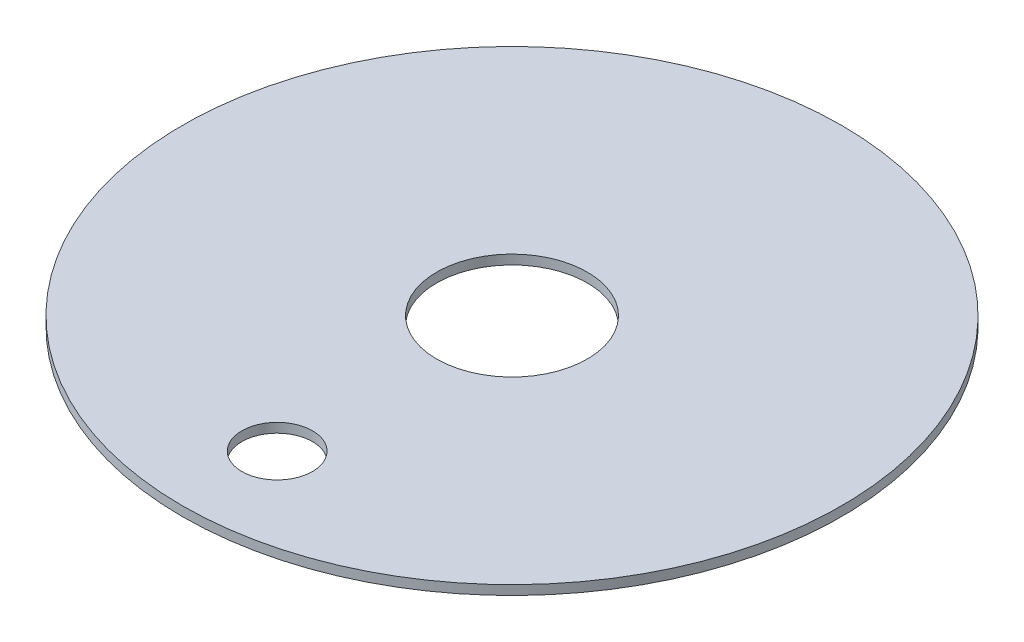
ISO-10303-21;
HEADER;
FILE_DESCRIPTION(('STEP AP214'),'2;1');
FILE_NAME('part.step','',(''),(''),'','','');
FILE_SCHEMA(('AUTOMOTIVE_DESIGN { 1 0 10303 214 1 1 1 1 }'));
ENDSEC;
DATA;
#1=APPLICATION_CONTEXT('core data for automotive mechanical design processes');
#2=APPLICATION_PROTOCOL_DEFINITION('international standard','automotive_design',2000,#1);
#3=PRODUCT_CONTEXT('',#1,'mechanical');
#4=PRODUCT('Part','Part','',(#3));
#5=PRODUCT_RELATED_PRODUCT_CATEGORY('part','',(#4));
#6=PRODUCT_DEFINITION_FORMATION('','',#4);
#7=PRODUCT_DEFINITION_CONTEXT('part definition',#1,'design');
#8=PRODUCT_DEFINITION('design','',#6,#7);
#9=PRODUCT_DEFINITION_SHAPE('','',#8);
#10=(LENGTH_UNIT() NAMED_UNIT(*) SI_UNIT(.MILLI.,.METRE.));
#11=(NAMED_UNIT(*) PLANE_ANGLE_UNIT() SI_UNIT($,.RADIAN.));
#12=(NAMED_UNIT(*) SI_UNIT($,.STERADIAN.) SOLID_ANGLE_UNIT());
#13=UNCERTAINTY_MEASURE_WITH_UNIT(LENGTH_MEASURE(1.E-05),#10,'distance_accuracy_value','');
#14=(GEOMETRIC_REPRESENTATION_CONTEXT(3) GLOBAL_UNCERTAINTY_ASSIGNED_CONTEXT((#13)) GLOBAL_UNIT_ASSIGNED_CONTEXT((#10,
#11,#12)) REPRESENTATION_CONTEXT('',''));
#15=CARTESIAN_POINT('',(0.,0.,0.));
#16=DIRECTION('',(0.,0.,1.));
#17=DIRECTION('',(1.,0.,0.));
#18=AXIS2_PLACEMENT_3D('',#15,#16,#17);
#19=CARTESIAN_POINT('',(0.,2.,0.));
#20=DIRECTION('',(0.,-1.,0.));
#21=DIRECTION('',(0.,0.,-1.));
#22=AXIS2_PLACEMENT_3D('',#19,#20,#21);
#23=CYLINDRICAL_SURFACE('',#22,70.);
#24=CARTESIAN_POINT('',(0.,2.,0.));
#25=DIRECTION('',(0.,1.,0.));
#26=DIRECTION('',(0.,0.,1.));
#27=AXIS2_PLACEMENT_3D('',#24,#25,#26);
#28=CIRCLE('',#27,70.);
#29=CARTESIAN_POINT('',(0.,2.,70.0000000000002));
#30=VERTEX_POINT('',#29);
#31=EDGE_CURVE('E48',#30,#30,#28,.T.);
#32=ORIENTED_EDGE('',*,*,#31,.F.);
#33=EDGE_LOOP('',(#32));
#34=FACE_BOUND('',#33,.T.);
#35=CARTESIAN_POINT('',(0.,0.,0.));
#36=DIRECTION('',(0.,1.,0.));
#37=DIRECTION('',(0.,0.,1.));
#38=AXIS2_PLACEMENT_3D('',#35,#36,#37);
#39=CIRCLE('',#38,70.);
#40=CARTESIAN_POINT('',(0.,0.,70.0000000000002));
#41=VERTEX_POINT('',#40);
#42=EDGE_CURVE('E54',#41,#41,#39,.T.);
#43=ORIENTED_EDGE('',*,*,#42,.T.);
#44=EDGE_LOOP('',(#43));
#45=FACE_BOUND('',#44,.T.);
#46=ADVANCED_FACE('F40',(#34,#45),#23,.T.);
#47=CARTESIAN_POINT('',(0.,2.,0.));
#48=DIRECTION('',(0.,1.,0.));
#49=DIRECTION('',(0.,0.,1.));
#50=AXIS2_PLACEMENT_3D('',#47,#48,#49);
#51=PLANE('',#50);
#52=CARTESIAN_POINT('',(0.,2.,49.88));
#53=DIRECTION('',(0.,1.,0.));
#54=DIRECTION('',(0.,0.,1.));
#55=AXIS2_PLACEMENT_3D('',#52,#53,#54);
#56=CIRCLE('',#55,7.5);
#57=CARTESIAN_POINT('',(0.,2.,57.38));
#58=VERTEX_POINT('',#57);
#59=EDGE_CURVE('E69',#58,#58,#56,.T.);
#60=ORIENTED_EDGE('',*,*,#59,.F.);
#61=EDGE_LOOP('',(#60));
#62=FACE_BOUND('',#61,.T.);
#63=CARTESIAN_POINT('',(0.,2.,0.));
#64=DIRECTION('',(0.,1.,0.));
#65=DIRECTION('',(0.,0.,1.));
#66=AXIS2_PLACEMENT_3D('',#63,#64,#65);
#67=CIRCLE('',#66,16.);
#68=CARTESIAN_POINT('',(0.,2.,16.));
#69=VERTEX_POINT('',#68);
#70=EDGE_CURVE('E68',#69,#69,#67,.T.);
#71=ORIENTED_EDGE('',*,*,#70,.F.);
#72=EDGE_LOOP('',(#71));
#73=FACE_BOUND('',#72,.T.);
#74=ORIENTED_EDGE('',*,*,#31,.T.);
#75=EDGE_LOOP('',(#74));
#76=FACE_BOUND('',#75,.T.);
#77=ADVANCED_FACE('F102',(#62,#73,#76),#51,.T.);
#78=CARTESIAN_POINT('',(0.,0.,0.));
#79=DIRECTION('',(0.,1.,0.));
#80=DIRECTION('',(0.,0.,1.));
#81=AXIS2_PLACEMENT_3D('',#78,#79,#80);
#82=PLANE('',#81);
#83=CARTESIAN_POINT('',(0.,0.,60.8800000000002));
#84=DIRECTION('',(0.,1.,0.));
#85=DIRECTION('',(0.,0.,1.));
#86=AXIS2_PLACEMENT_3D('',#83,#84,#85);
#87=CIRCLE('',#86,1.);
#88=CARTESIAN_POINT('',(0.,0.,61.8800000000002));
#89=VERTEX_POINT('',#88);
#90=EDGE_CURVE('E77',#89,#89,#87,.T.);
#91=ORIENTED_EDGE('',*,*,#90,.T.);
#92=EDGE_LOOP('',(#91));
#93=FACE_BOUND('',#92,.T.);
#94=CARTESIAN_POINT('',(0.,0.,49.88));
#95=DIRECTION('',(0.,1.,0.));
#96=DIRECTION('',(0.,0.,1.));
#97=AXIS2_PLACEMENT_3D('',#94,#95,#96);
#98=CIRCLE('',#97,7.5);
#99=CARTESIAN_POINT('',(0.,0.,57.38));
#100=VERTEX_POINT('',#99);
#101=EDGE_CURVE('E65',#100,#100,#98,.T.);
#102=ORIENTED_EDGE('',*,*,#101,.T.);
#103=EDGE_LOOP('',(#102));
#104=FACE_BOUND('',#103,.T.);
#105=CARTESIAN_POINT('',(0.,0.,0.));
#106=DIRECTION('',(0.,1.,0.));
#107=DIRECTION('',(0.,0.,1.));
#108=AXIS2_PLACEMENT_3D('',#105,#106,#107);
#109=CIRCLE('',#108,16.);
#110=CARTESIAN_POINT('',(0.,0.,16.));
#111=VERTEX_POINT('',#110);
#112=EDGE_CURVE('E61',#111,#111,#109,.F.);
#113=ORIENTED_EDGE('',*,*,#112,.F.);
#114=EDGE_LOOP('',(#113));
#115=FACE_BOUND('',#114,.T.);
#116=ORIENTED_EDGE('',*,*,#42,.F.);
#117=EDGE_LOOP('',(#116));
#118=FACE_BOUND('',#117,.T.);
#119=ADVANCED_FACE('F88',(#93,#104,#115,#118),#82,.F.);
#120=CARTESIAN_POINT('',(0.,-0.001000000000001,0.));
#121=DIRECTION('',(0.,1.,0.));
#122=DIRECTION('',(0.,0.,1.));
#123=AXIS2_PLACEMENT_3D('',#120,#121,#122);
#124=CYLINDRICAL_SURFACE('',#123,16.);
#125=ORIENTED_EDGE('',*,*,#70,.T.);
#126=EDGE_LOOP('',(#125));
#127=FACE_BOUND('',#126,.T.);
#128=ORIENTED_EDGE('',*,*,#112,.T.);
#129=EDGE_LOOP('',(#128));
#130=FACE_BOUND('',#129,.T.);
#131=ADVANCED_FACE('F99',(#127,#130),#124,.F.);
#132=CARTESIAN_POINT('',(0.,-8.00000000000001,49.88));
#133=DIRECTION('',(0.,1.,0.));
#134=DIRECTION('',(0.,0.,1.));
#135=AXIS2_PLACEMENT_3D('',#132,#133,#134);
#136=CYLINDRICAL_SURFACE('',#135,7.5);
#137=ORIENTED_EDGE('',*,*,#59,.T.);
#138=EDGE_LOOP('',(#137));
#139=FACE_BOUND('',#138,.T.);
#140=ORIENTED_EDGE('',*,*,#101,.F.);
#141=EDGE_LOOP('',(#140));
#142=FACE_BOUND('',#141,.T.);
#143=ADVANCED_FACE('F92',(#139,#142),#136,.F.);
#144=CARTESIAN_POINT('',(0.,-4.,60.8800000000002));
#145=DIRECTION('',(0.,1.,0.));
#146=DIRECTION('',(0.,0.,1.));
#147=AXIS2_PLACEMENT_3D('',#144,#145,#146);
#148=CYLINDRICAL_SURFACE('',#147,1.);
#149=CARTESIAN_POINT('',(0.,-3.,60.8800000000002));
#150=DIRECTION('',(0.,1.,0.));
#151=DIRECTION('',(0.,0.,1.));
#152=AXIS2_PLACEMENT_3D('',#149,#150,#151);
#153=CIRCLE('',#152,1.);
#154=CARTESIAN_POINT('',(0.,-3.,61.8800000000002));
#155=VERTEX_POINT('',#154);
#156=EDGE_CURVE('E10',#155,#155,#153,.T.);
#157=ORIENTED_EDGE('',*,*,#156,.T.);
#158=EDGE_LOOP('',(#157));
#159=FACE_BOUND('',#158,.T.);
#160=ORIENTED_EDGE('',*,*,#90,.F.);
#161=EDGE_LOOP('',(#160));
#162=FACE_BOUND('',#161,.T.);
#163=ADVANCED_FACE('F90',(#159,#162),#148,.T.);
#164=CARTESIAN_POINT('',(0.,-3.,60.8800000000002));
#165=DIRECTION('',(0.,1.,0.));
#166=DIRECTION('',(0.,0.,1.));
#167=AXIS2_PLACEMENT_3D('',#164,#165,#166);
#168=SPHERICAL_SURFACE('',#167,1.);
#169=ORIENTED_EDGE('',*,*,#156,.F.);
#170=EDGE_LOOP('',(#169));
#171=FACE_BOUND('',#170,.T.);
#172=ADVANCED_FACE('F42',(#171),#168,.T.);
#173=CLOSED_SHELL('',(#46,#77,#119,#131,#143,#163,#172));
#174=MANIFOLD_SOLID_BREP('B2',#173);
#175=ADVANCED_BREP_SHAPE_REPRESENTATION('',(#18,#174),#14);
#176=SHAPE_DEFINITION_REPRESENTATION(#9,#175);
ENDSEC;
END-ISO-10303-21;
